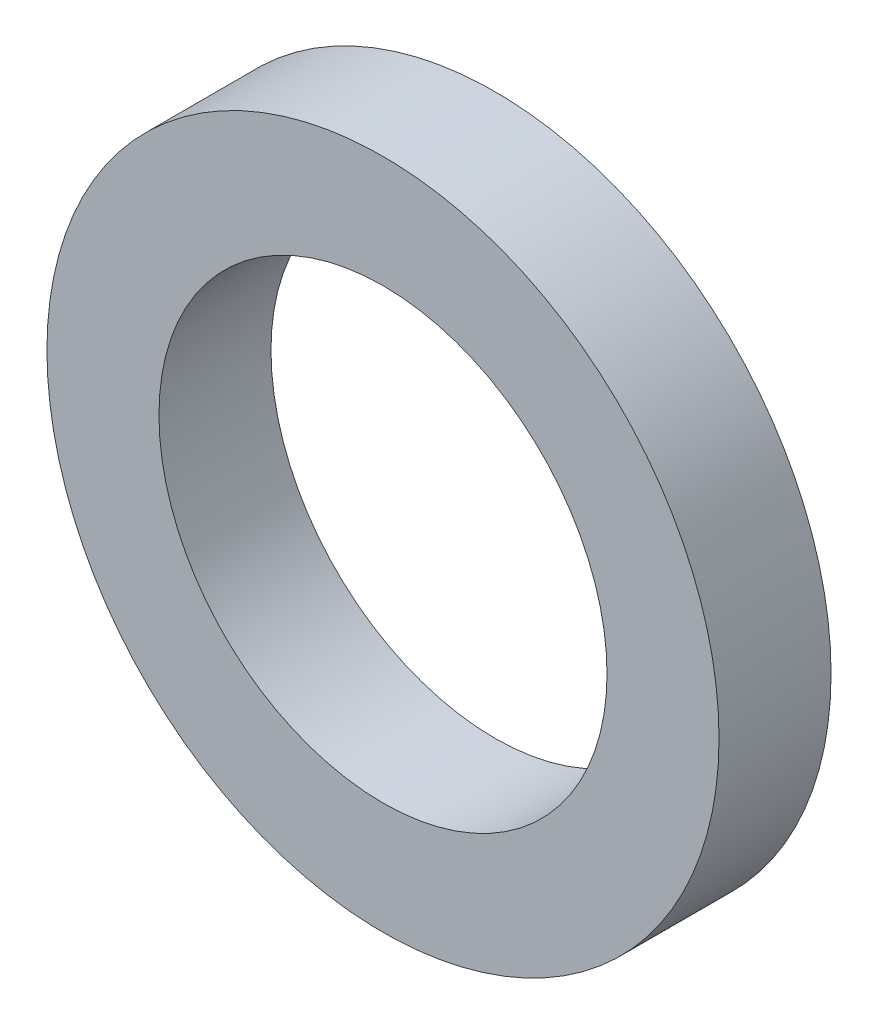
ISO-10303-21;
HEADER;
FILE_DESCRIPTION(('STEP AP214'),'2;1');
FILE_NAME('part.step','',(''),(''),'','','');
FILE_SCHEMA(('AUTOMOTIVE_DESIGN { 1 0 10303 214 1 1 1 1 }'));
ENDSEC;
DATA;
#1=APPLICATION_CONTEXT('core data for automotive mechanical design processes');
#2=APPLICATION_PROTOCOL_DEFINITION('international standard','automotive_design',2000,#1);
#3=PRODUCT_CONTEXT('',#1,'mechanical');
#4=PRODUCT('Part','Part','',(#3));
#5=PRODUCT_RELATED_PRODUCT_CATEGORY('part','',(#4));
#6=PRODUCT_DEFINITION_FORMATION('','',#4);
#7=PRODUCT_DEFINITION_CONTEXT('part definition',#1,'design');
#8=PRODUCT_DEFINITION('design','',#6,#7);
#9=PRODUCT_DEFINITION_SHAPE('','',#8);
#10=(LENGTH_UNIT() NAMED_UNIT(*) SI_UNIT(.MILLI.,.METRE.));
#11=(NAMED_UNIT(*) PLANE_ANGLE_UNIT() SI_UNIT($,.RADIAN.));
#12=(NAMED_UNIT(*) SI_UNIT($,.STERADIAN.) SOLID_ANGLE_UNIT());
#13=UNCERTAINTY_MEASURE_WITH_UNIT(LENGTH_MEASURE(1.E-05),#10,'distance_accuracy_value','');
#14=(GEOMETRIC_REPRESENTATION_CONTEXT(3) GLOBAL_UNCERTAINTY_ASSIGNED_CONTEXT((#13)) GLOBAL_UNIT_ASSIGNED_CONTEXT((#10,
#11,#12)) REPRESENTATION_CONTEXT('',''));
#15=CARTESIAN_POINT('',(0.,0.,0.));
#16=DIRECTION('',(0.,0.,1.));
#17=DIRECTION('',(1.,0.,0.));
#18=AXIS2_PLACEMENT_3D('',#15,#16,#17);
#19=CARTESIAN_POINT('',(0.,0.,5.));
#20=DIRECTION('',(0.,0.,1.));
#21=DIRECTION('',(1.,0.,0.));
#22=AXIS2_PLACEMENT_3D('',#19,#20,#21);
#23=PLANE('',#22);
#24=CARTESIAN_POINT('',(0.,0.,5.));
#25=DIRECTION('',(0.,0.,1.));
#26=DIRECTION('',(1.,0.,0.));
#27=AXIS2_PLACEMENT_3D('',#24,#25,#26);
#28=CIRCLE('',#27,15.);
#29=CARTESIAN_POINT('',(15.,0.,5.));
#30=VERTEX_POINT('',#29);
#31=EDGE_CURVE('E10',#30,#30,#28,.T.);
#32=ORIENTED_EDGE('',*,*,#31,.T.);
#33=EDGE_LOOP('',(#32));
#34=FACE_BOUND('',#33,.T.);
#35=CARTESIAN_POINT('',(0.,0.,5.));
#36=DIRECTION('',(0.,0.,1.));
#37=DIRECTION('',(1.,0.,0.));
#38=AXIS2_PLACEMENT_3D('',#35,#36,#37);
#39=CIRCLE('',#38,10.);
#40=CARTESIAN_POINT('',(10.,0.,5.));
#41=VERTEX_POINT('',#40);
#42=EDGE_CURVE('E41',#41,#41,#39,.T.);
#43=ORIENTED_EDGE('',*,*,#42,.F.);
#44=EDGE_LOOP('',(#43));
#45=FACE_BOUND('',#44,.T.);
#46=ADVANCED_FACE('F30',(#34,#45),#23,.T.);
#47=CARTESIAN_POINT('',(0.,0.,0.));
#48=DIRECTION('',(0.,0.,1.));
#49=DIRECTION('',(1.,0.,0.));
#50=AXIS2_PLACEMENT_3D('',#47,#48,#49);
#51=PLANE('',#50);
#52=CARTESIAN_POINT('',(0.,0.,0.));
#53=DIRECTION('',(0.,0.,1.));
#54=DIRECTION('',(1.,0.,0.));
#55=AXIS2_PLACEMENT_3D('',#52,#53,#54);
#56=CIRCLE('',#55,15.);
#57=CARTESIAN_POINT('',(15.,0.,0.));
#58=VERTEX_POINT('',#57);
#59=EDGE_CURVE('E34',#58,#58,#56,.T.);
#60=ORIENTED_EDGE('',*,*,#59,.F.);
#61=EDGE_LOOP('',(#60));
#62=FACE_BOUND('',#61,.T.);
#63=CARTESIAN_POINT('',(0.,0.,0.));
#64=DIRECTION('',(0.,0.,1.));
#65=DIRECTION('',(1.,0.,0.));
#66=AXIS2_PLACEMENT_3D('',#63,#64,#65);
#67=CIRCLE('',#66,10.);
#68=CARTESIAN_POINT('',(10.,0.,0.));
#69=VERTEX_POINT('',#68);
#70=EDGE_CURVE('E43',#69,#69,#67,.T.);
#71=ORIENTED_EDGE('',*,*,#70,.T.);
#72=EDGE_LOOP('',(#71));
#73=FACE_BOUND('',#72,.T.);
#74=ADVANCED_FACE('F53',(#62,#73),#51,.F.);
#75=CARTESIAN_POINT('',(0.,0.,5.));
#76=DIRECTION('',(0.,0.,-1.));
#77=DIRECTION('',(-1.,0.,0.));
#78=AXIS2_PLACEMENT_3D('',#75,#76,#77);
#79=CYLINDRICAL_SURFACE('',#78,15.);
#80=ORIENTED_EDGE('',*,*,#31,.F.);
#81=EDGE_LOOP('',(#80));
#82=FACE_BOUND('',#81,.T.);
#83=ORIENTED_EDGE('',*,*,#59,.T.);
#84=EDGE_LOOP('',(#83));
#85=FACE_BOUND('',#84,.T.);
#86=ADVANCED_FACE('F32',(#82,#85),#79,.T.);
#87=CARTESIAN_POINT('',(0.,0.,5.));
#88=DIRECTION('',(0.,0.,-1.));
#89=DIRECTION('',(-1.,0.,0.));
#90=AXIS2_PLACEMENT_3D('',#87,#88,#89);
#91=CYLINDRICAL_SURFACE('',#90,10.);
#92=ORIENTED_EDGE('',*,*,#42,.T.);
#93=EDGE_LOOP('',(#92));
#94=FACE_BOUND('',#93,.T.);
#95=ORIENTED_EDGE('',*,*,#70,.F.);
#96=EDGE_LOOP('',(#95));
#97=FACE_BOUND('',#96,.T.);
#98=ADVANCED_FACE('F49',(#94,#97),#91,.F.);
#99=CLOSED_SHELL('',(#46,#74,#86,#98));
#100=MANIFOLD_SOLID_BREP('B2',#99);
#101=ADVANCED_BREP_SHAPE_REPRESENTATION('',(#18,#100),#14);
#102=SHAPE_DEFINITION_REPRESENTATION(#9,#101);
ENDSEC;
END-ISO-10303-21;
